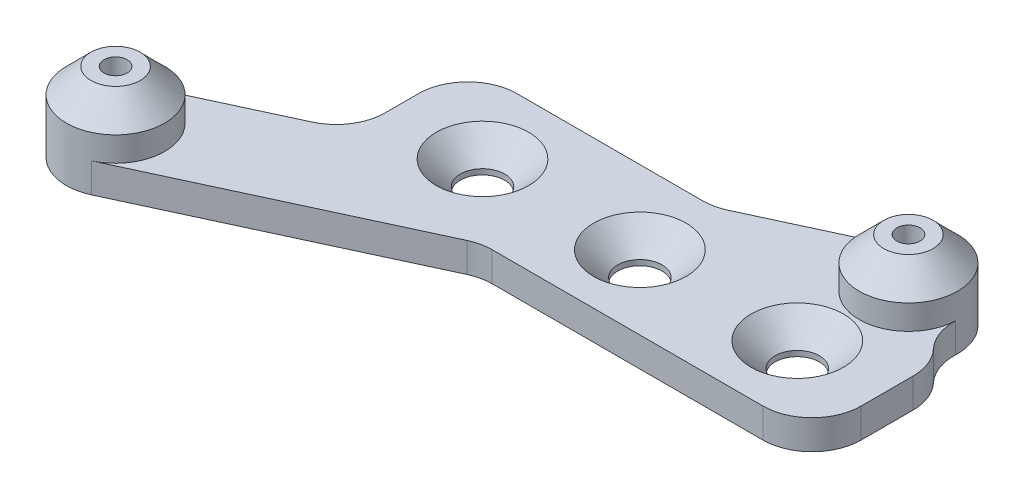
ISO-10303-21;
HEADER;
FILE_DESCRIPTION(('STEP AP214'),'2;1');
FILE_NAME('part.step','',(''),(''),'','','');
FILE_SCHEMA(('AUTOMOTIVE_DESIGN { 1 0 10303 214 1 1 1 1 }'));
ENDSEC;
DATA;
#1=APPLICATION_CONTEXT('core data for automotive mechanical design processes');
#2=APPLICATION_PROTOCOL_DEFINITION('international standard','automotive_design',2000,#1);
#3=PRODUCT_CONTEXT('',#1,'mechanical');
#4=PRODUCT('Part','Part','',(#3));
#5=PRODUCT_RELATED_PRODUCT_CATEGORY('part','',(#4));
#6=PRODUCT_DEFINITION_FORMATION('','',#4);
#7=PRODUCT_DEFINITION_CONTEXT('part definition',#1,'design');
#8=PRODUCT_DEFINITION('design','',#6,#7);
#9=PRODUCT_DEFINITION_SHAPE('','',#8);
#10=(LENGTH_UNIT() NAMED_UNIT(*) SI_UNIT(.MILLI.,.METRE.));
#11=(NAMED_UNIT(*) PLANE_ANGLE_UNIT() SI_UNIT($,.RADIAN.));
#12=(NAMED_UNIT(*) SI_UNIT($,.STERADIAN.) SOLID_ANGLE_UNIT());
#13=UNCERTAINTY_MEASURE_WITH_UNIT(LENGTH_MEASURE(1.E-05),#10,'distance_accuracy_value','');
#14=(GEOMETRIC_REPRESENTATION_CONTEXT(3) GLOBAL_UNCERTAINTY_ASSIGNED_CONTEXT((#13)) GLOBAL_UNIT_ASSIGNED_CONTEXT((#10,
#11,#12)) REPRESENTATION_CONTEXT('',''));
#15=CARTESIAN_POINT('',(0.,0.,0.));
#16=DIRECTION('',(0.,0.,1.));
#17=DIRECTION('',(1.,0.,0.));
#18=AXIS2_PLACEMENT_3D('',#15,#16,#17);
#19=CARTESIAN_POINT('',(17.3,3.,-10.));
#20=DIRECTION('',(0.,1.,0.));
#21=DIRECTION('',(0.,0.,1.));
#22=AXIS2_PLACEMENT_3D('',#19,#20,#21);
#23=PLANE('',#22);
#24=CARTESIAN_POINT('',(0.,3.,0.));
#25=DIRECTION('',(0.,1.,0.));
#26=DIRECTION('',(0.,0.,1.));
#27=AXIS2_PLACEMENT_3D('',#24,#25,#26);
#28=CIRCLE('',#27,4.7);
#29=CARTESIAN_POINT('',(0.,3.,4.7));
#30=VERTEX_POINT('',#29);
#31=EDGE_CURVE('E650',#30,#30,#28,.T.);
#32=ORIENTED_EDGE('',*,*,#31,.F.);
#33=EDGE_LOOP('',(#32));
#34=FACE_BOUND('',#33,.T.);
#35=CARTESIAN_POINT('',(-16.,3.,0.));
#36=DIRECTION('',(0.,1.,0.));
#37=DIRECTION('',(0.,0.,1.));
#38=AXIS2_PLACEMENT_3D('',#35,#36,#37);
#39=CIRCLE('',#38,4.7);
#40=CARTESIAN_POINT('',(-16.,3.,4.7));
#41=VERTEX_POINT('',#40);
#42=EDGE_CURVE('E267',#41,#41,#39,.T.);
#43=ORIENTED_EDGE('',*,*,#42,.F.);
#44=EDGE_LOOP('',(#43));
#45=FACE_BOUND('',#44,.T.);
#46=CARTESIAN_POINT('',(16.,3.,0.));
#47=DIRECTION('',(0.,1.,0.));
#48=DIRECTION('',(0.,0.,1.));
#49=AXIS2_PLACEMENT_3D('',#46,#47,#48);
#50=CIRCLE('',#49,4.7);
#51=CARTESIAN_POINT('',(16.,3.,4.7));
#52=VERTEX_POINT('',#51);
#53=EDGE_CURVE('E262',#52,#52,#50,.T.);
#54=ORIENTED_EDGE('',*,*,#53,.F.);
#55=EDGE_LOOP('',(#54));
#56=FACE_BOUND('',#55,.T.);
#57=DIRECTION('',(0.,0.,-1.));
#58=VECTOR('',#57,1.);
#59=CARTESIAN_POINT('',(25.,3.,-7.5));
#60=LINE('',#59,#58);
#61=CARTESIAN_POINT('',(25.,3.,2.5));
#62=VERTEX_POINT('',#61);
#63=CARTESIAN_POINT('',(25.,3.,-2.77319495830642));
#64=VERTEX_POINT('',#63);
#65=EDGE_CURVE('E220',#62,#64,#60,.T.);
#66=ORIENTED_EDGE('',*,*,#65,.T.);
#67=CARTESIAN_POINT('',(20.,3.,-2.77319495830642));
#68=DIRECTION('',(0.,1.,0.));
#69=DIRECTION('',(0.,0.,1.));
#70=AXIS2_PLACEMENT_3D('',#67,#68,#69);
#71=CIRCLE('',#70,5.);
#72=CARTESIAN_POINT('',(23.6463036669686,3.,-6.19437451633185));
#73=VERTEX_POINT('',#72);
#74=EDGE_CURVE('E361',#64,#73,#71,.T.);
#75=ORIENTED_EDGE('',*,*,#74,.T.);
#76=CARTESIAN_POINT('',(27.2926073339373,3.,-9.61555407435728));
#77=DIRECTION('',(0.,1.,0.));
#78=DIRECTION('',(0.,0.,1.));
#79=AXIS2_PLACEMENT_3D('',#76,#77,#78);
#80=CIRCLE('',#79,5.);
#81=CARTESIAN_POINT('',(22.2963036669686,3.,-9.80777703717865));
#82=VERTEX_POINT('',#81);
#83=EDGE_CURVE('E251',#73,#82,#80,.F.);
#84=ORIENTED_EDGE('',*,*,#83,.T.);
#85=CARTESIAN_POINT('',(17.3,3.,-10.));
#86=DIRECTION('',(0.,1.,0.));
#87=DIRECTION('',(0.,0.,1.));
#88=AXIS2_PLACEMENT_3D('',#85,#86,#87);
#89=CIRCLE('',#88,5.);
#90=CARTESIAN_POINT('',(15.2000101148058,3.,-14.5376252029098));
#91=VERTEX_POINT('',#90);
#92=EDGE_CURVE('E48',#91,#82,#89,.T.);
#93=ORIENTED_EDGE('',*,*,#92,.F.);
#94=DIRECTION('',(-0.907525040581958,0.,0.419997977038837));
#95=VECTOR('',#94,1.);
#96=CARTESIAN_POINT('',(-39.8999898851942,3.,10.9623747970902));
#97=LINE('',#96,#95);
#98=CARTESIAN_POINT('',(0.99231217909368,3.,-7.96237479709021));
#99=VERTEX_POINT('',#98);
#100=EDGE_CURVE('E156',#91,#99,#97,.T.);
#101=ORIENTED_EDGE('',*,*,#100,.T.);
#102=CARTESIAN_POINT('',(-1.10767770610051,3.,-12.5));
#103=DIRECTION('',(0.,1.,0.));
#104=DIRECTION('',(0.,0.,1.));
#105=AXIS2_PLACEMENT_3D('',#102,#103,#104);
#106=CIRCLE('',#105,5.);
#107=CARTESIAN_POINT('',(-1.10767770610051,3.,-7.5));
#108=VERTEX_POINT('',#107);
#109=EDGE_CURVE('E243',#99,#108,#106,.F.);
#110=ORIENTED_EDGE('',*,*,#109,.T.);
#111=DIRECTION('',(-1.,0.,0.));
#112=VECTOR('',#111,1.);
#113=CARTESIAN_POINT('',(25.,3.,-7.5));
#114=LINE('',#113,#112);
#115=CARTESIAN_POINT('',(-20.,3.,-7.5));
#116=VERTEX_POINT('',#115);
#117=EDGE_CURVE('E215',#108,#116,#114,.T.);
#118=ORIENTED_EDGE('',*,*,#117,.T.);
#119=CARTESIAN_POINT('',(-20.,3.,-2.5));
#120=DIRECTION('',(0.,1.,0.));
#121=DIRECTION('',(0.,0.,1.));
#122=AXIS2_PLACEMENT_3D('',#119,#120,#121);
#123=CIRCLE('',#122,5.);
#124=CARTESIAN_POINT('',(-25.,3.,-2.49999999999999));
#125=VERTEX_POINT('',#124);
#126=EDGE_CURVE('E404',#116,#125,#123,.T.);
#127=ORIENTED_EDGE('',*,*,#126,.T.);
#128=DIRECTION('',(0.,0.,1.));
#129=VECTOR('',#128,1.);
#130=CARTESIAN_POINT('',(-25.,3.,-7.5));
#131=LINE('',#130,#129);
#132=CARTESIAN_POINT('',(-25.,3.,0.871219936378182));
#133=VERTEX_POINT('',#132);
#134=EDGE_CURVE('E370',#125,#133,#131,.T.);
#135=ORIENTED_EDGE('',*,*,#134,.T.);
#136=CARTESIAN_POINT('',(-30.,3.,0.871219936378183));
#137=DIRECTION('',(0.,1.,0.));
#138=DIRECTION('',(0.,0.,1.));
#139=AXIS2_PLACEMENT_3D('',#136,#137,#138);
#140=CIRCLE('',#139,5.);
#141=CARTESIAN_POINT('',(-27.9000101148058,3.,5.40884513928797));
#142=VERTEX_POINT('',#141);
#143=EDGE_CURVE('E231',#133,#142,#140,.F.);
#144=ORIENTED_EDGE('',*,*,#143,.T.);
#145=CARTESIAN_POINT('',(-39.8999898851942,3.,10.9623747970902));
#146=VERTEX_POINT('',#145);
#147=EDGE_CURVE('E169',#142,#146,#97,.T.);
#148=ORIENTED_EDGE('',*,*,#147,.T.);
#149=CARTESIAN_POINT('',(-37.8,3.,15.5));
#150=DIRECTION('',(0.,1.,0.));
#151=DIRECTION('',(0.,0.,1.));
#152=AXIS2_PLACEMENT_3D('',#149,#150,#151);
#153=CIRCLE('',#152,5.);
#154=CARTESIAN_POINT('',(-35.7000101148058,3.,20.0376252029098));
#155=VERTEX_POINT('',#154);
#156=EDGE_CURVE('E162',#155,#146,#153,.T.);
#157=ORIENTED_EDGE('',*,*,#156,.F.);
#158=DIRECTION('',(0.907525040581958,0.,-0.419997977038837));
#159=VECTOR('',#158,1.);
#160=CARTESIAN_POINT('',(-35.7000101148058,3.,20.0376252029098));
#161=LINE('',#160,#159);
#162=CARTESIAN_POINT('',(-9.60799845360353,3.,7.96237479709021));
#163=VERTEX_POINT('',#162);
#164=EDGE_CURVE('E145',#155,#163,#161,.T.);
#165=ORIENTED_EDGE('',*,*,#164,.T.);
#166=CARTESIAN_POINT('',(-7.50800856840935,3.,12.5));
#167=DIRECTION('',(0.,1.,0.));
#168=DIRECTION('',(0.,0.,1.));
#169=AXIS2_PLACEMENT_3D('',#166,#167,#168);
#170=CIRCLE('',#169,5.);
#171=CARTESIAN_POINT('',(-7.50800856840935,3.,7.5));
#172=VERTEX_POINT('',#171);
#173=EDGE_CURVE('E230',#163,#172,#170,.F.);
#174=ORIENTED_EDGE('',*,*,#173,.T.);
#175=DIRECTION('',(1.,0.,0.));
#176=VECTOR('',#175,1.);
#177=CARTESIAN_POINT('',(25.,3.,7.5));
#178=LINE('',#177,#176);
#179=CARTESIAN_POINT('',(20.,3.,7.5));
#180=VERTEX_POINT('',#179);
#181=EDGE_CURVE('E368',#172,#180,#178,.T.);
#182=ORIENTED_EDGE('',*,*,#181,.T.);
#183=CARTESIAN_POINT('',(20.,3.,2.5));
#184=DIRECTION('',(0.,1.,0.));
#185=DIRECTION('',(0.,0.,1.));
#186=AXIS2_PLACEMENT_3D('',#183,#184,#185);
#187=CIRCLE('',#186,5.);
#188=EDGE_CURVE('E206',#180,#62,#187,.T.);
#189=ORIENTED_EDGE('',*,*,#188,.T.);
#190=EDGE_LOOP('',(#66,#75,#84,#93,#101,#110,#118,#127,#135,#144,#148,#157,#165,#174,#182,#189));
#191=FACE_BOUND('',#190,.T.);
#192=ADVANCED_FACE('F33',(#34,#45,#56,#191),#23,.T.);
#193=CARTESIAN_POINT('',(17.3,3.,-10.));
#194=DIRECTION('',(0.,-1.,0.));
#195=DIRECTION('',(0.,0.,-1.));
#196=AXIS2_PLACEMENT_3D('',#193,#194,#195);
#197=CYLINDRICAL_SURFACE('',#196,5.);
#198=CARTESIAN_POINT('',(17.3,5.49999999999998,-10.));
#199=DIRECTION('',(0.,1.,0.));
#200=DIRECTION('',(0.,0.,1.));
#201=AXIS2_PLACEMENT_3D('',#198,#199,#200);
#202=CIRCLE('',#201,5.);
#203=CARTESIAN_POINT('',(17.3,5.49999999999998,-5.00000000000002));
#204=VERTEX_POINT('',#203);
#205=EDGE_CURVE('E271',#204,#204,#202,.F.);
#206=ORIENTED_EDGE('',*,*,#205,.T.);
#207=EDGE_LOOP('',(#206));
#208=FACE_BOUND('',#207,.T.);
#209=ORIENTED_EDGE('',*,*,#92,.T.);
#210=DIRECTION('',(0.,-1.,0.));
#211=VECTOR('',#210,1.);
#212=CARTESIAN_POINT('',(22.2963036669686,3.,-9.80777703717865));
#213=LINE('',#212,#211);
#214=CARTESIAN_POINT('',(22.2963036669686,0.,-9.80777703717865));
#215=VERTEX_POINT('',#214);
#216=EDGE_CURVE('E53',#82,#215,#213,.T.);
#217=ORIENTED_EDGE('',*,*,#216,.T.);
#218=CARTESIAN_POINT('',(17.3,0.,-10.));
#219=DIRECTION('',(0.,1.,0.));
#220=DIRECTION('',(0.,0.,1.));
#221=AXIS2_PLACEMENT_3D('',#218,#219,#220);
#222=CIRCLE('',#221,5.);
#223=CARTESIAN_POINT('',(15.2000101148058,0.,-14.5376252029098));
#224=VERTEX_POINT('',#223);
#225=EDGE_CURVE('E217',#215,#224,#222,.T.);
#226=ORIENTED_EDGE('',*,*,#225,.T.);
#227=DIRECTION('',(0.,-1.,0.));
#228=VECTOR('',#227,1.);
#229=CARTESIAN_POINT('',(15.2000101148058,3.,-14.5376252029098));
#230=LINE('',#229,#228);
#231=EDGE_CURVE('E185',#91,#224,#230,.T.);
#232=ORIENTED_EDGE('',*,*,#231,.F.);
#233=EDGE_LOOP('',(#209,#217,#226,#232));
#234=FACE_BOUND('',#233,.T.);
#235=ADVANCED_FACE('F289',(#208,#234),#197,.T.);
#236=CARTESIAN_POINT('',(-39.8999898851942,3.,10.9623747970902));
#237=DIRECTION('',(0.419997977038837,0.,0.907525040581958));
#238=DIRECTION('',(0.907525040581958,0.,-0.419997977038838));
#239=AXIS2_PLACEMENT_3D('',#236,#237,#238);
#240=PLANE('',#239);
#241=ORIENTED_EDGE('',*,*,#147,.F.);
#242=DIRECTION('',(0.,1.,0.));
#243=VECTOR('',#242,1.);
#244=CARTESIAN_POINT('',(-27.9000101148058,0.,5.40884513928797));
#245=LINE('',#244,#243);
#246=CARTESIAN_POINT('',(-27.9000101148058,0.,5.40884513928797));
#247=VERTEX_POINT('',#246);
#248=EDGE_CURVE('E396',#142,#247,#245,.F.);
#249=ORIENTED_EDGE('',*,*,#248,.T.);
#250=DIRECTION('',(-0.907525040581958,0.,0.419997977038837));
#251=VECTOR('',#250,1.);
#252=CARTESIAN_POINT('',(-39.8999898851942,0.,10.9623747970902));
#253=LINE('',#252,#251);
#254=CARTESIAN_POINT('',(-39.8999898851942,0.,10.9623747970902));
#255=VERTEX_POINT('',#254);
#256=EDGE_CURVE('E219',#247,#255,#253,.T.);
#257=ORIENTED_EDGE('',*,*,#256,.T.);
#258=DIRECTION('',(0.,-1.,0.));
#259=VECTOR('',#258,1.);
#260=CARTESIAN_POINT('',(-39.8999898851942,3.,10.9623747970902));
#261=LINE('',#260,#259);
#262=EDGE_CURVE('E165',#146,#255,#261,.T.);
#263=ORIENTED_EDGE('',*,*,#262,.F.);
#264=EDGE_LOOP('',(#241,#249,#257,#263));
#265=FACE_BOUND('',#264,.T.);
#266=ADVANCED_FACE('F297',(#265),#240,.F.);
#267=CARTESIAN_POINT('',(0.99231217909368,0.,-7.96237479709021));
#268=VERTEX_POINT('',#267);
#269=EDGE_CURVE('E221',#224,#268,#253,.T.);
#270=ORIENTED_EDGE('',*,*,#269,.T.);
#271=DIRECTION('',(0.,-1.,0.));
#272=VECTOR('',#271,1.);
#273=CARTESIAN_POINT('',(0.992312179093677,3.,-7.96237479709021));
#274=LINE('',#273,#272);
#275=EDGE_CURVE('E389',#268,#99,#274,.F.);
#276=ORIENTED_EDGE('',*,*,#275,.T.);
#277=ORIENTED_EDGE('',*,*,#100,.F.);
#278=ORIENTED_EDGE('',*,*,#231,.T.);
#279=EDGE_LOOP('',(#270,#276,#277,#278));
#280=FACE_BOUND('',#279,.T.);
#281=ADVANCED_FACE('F313',(#280),#240,.F.);
#282=CARTESIAN_POINT('',(-35.7000101148058,3.,20.0376252029098));
#283=DIRECTION('',(-0.419997977038837,0.,-0.907525040581958));
#284=DIRECTION('',(-0.907525040581958,0.,0.419997977038838));
#285=AXIS2_PLACEMENT_3D('',#282,#283,#284);
#286=PLANE('',#285);
#287=DIRECTION('',(0.907525040581958,0.,-0.419997977038837));
#288=VECTOR('',#287,1.);
#289=CARTESIAN_POINT('',(-35.7000101148058,0.,20.0376252029098));
#290=LINE('',#289,#288);
#291=CARTESIAN_POINT('',(-35.7000101148058,0.,20.0376252029098));
#292=VERTEX_POINT('',#291);
#293=CARTESIAN_POINT('',(-9.60799845360353,0.,7.96237479709021));
#294=VERTEX_POINT('',#293);
#295=EDGE_CURVE('E209',#292,#294,#290,.T.);
#296=ORIENTED_EDGE('',*,*,#295,.T.);
#297=DIRECTION('',(0.,-1.,0.));
#298=VECTOR('',#297,1.);
#299=CARTESIAN_POINT('',(-9.60799845360353,3.,7.96237479709021));
#300=LINE('',#299,#298);
#301=EDGE_CURVE('E152',#294,#163,#300,.F.);
#302=ORIENTED_EDGE('',*,*,#301,.T.);
#303=ORIENTED_EDGE('',*,*,#164,.F.);
#304=DIRECTION('',(0.,-1.,0.));
#305=VECTOR('',#304,1.);
#306=CARTESIAN_POINT('',(-35.7000101148058,3.,20.0376252029098));
#307=LINE('',#306,#305);
#308=EDGE_CURVE('E149',#155,#292,#307,.T.);
#309=ORIENTED_EDGE('',*,*,#308,.T.);
#310=EDGE_LOOP('',(#296,#302,#303,#309));
#311=FACE_BOUND('',#310,.T.);
#312=ADVANCED_FACE('F148',(#311),#286,.F.);
#313=CARTESIAN_POINT('',(-37.8,3.,15.5));
#314=DIRECTION('',(0.,-1.,0.));
#315=DIRECTION('',(0.,0.,-1.));
#316=AXIS2_PLACEMENT_3D('',#313,#314,#315);
#317=CYLINDRICAL_SURFACE('',#316,5.);
#318=CARTESIAN_POINT('',(-37.8,5.49999999999999,15.5));
#319=DIRECTION('',(0.,1.,0.));
#320=DIRECTION('',(0.,0.,1.));
#321=AXIS2_PLACEMENT_3D('',#318,#319,#320);
#322=CIRCLE('',#321,5.);
#323=CARTESIAN_POINT('',(-37.8,5.49999999999999,20.5));
#324=VERTEX_POINT('',#323);
#325=EDGE_CURVE('E11',#324,#324,#322,.F.);
#326=ORIENTED_EDGE('',*,*,#325,.T.);
#327=EDGE_LOOP('',(#326));
#328=FACE_BOUND('',#327,.T.);
#329=CARTESIAN_POINT('',(-37.8,0.,15.5));
#330=DIRECTION('',(0.,1.,0.));
#331=DIRECTION('',(0.,0.,1.));
#332=AXIS2_PLACEMENT_3D('',#329,#330,#331);
#333=CIRCLE('',#332,5.);
#334=EDGE_CURVE('E164',#255,#292,#333,.T.);
#335=ORIENTED_EDGE('',*,*,#334,.T.);
#336=ORIENTED_EDGE('',*,*,#308,.F.);
#337=ORIENTED_EDGE('',*,*,#156,.T.);
#338=ORIENTED_EDGE('',*,*,#262,.T.);
#339=EDGE_LOOP('',(#335,#336,#337,#338));
#340=FACE_BOUND('',#339,.T.);
#341=ADVANCED_FACE('F160',(#328,#340),#317,.T.);
#342=CARTESIAN_POINT('',(17.3,0.,-10.));
#343=DIRECTION('',(0.,1.,0.));
#344=DIRECTION('',(0.,0.,1.));
#345=AXIS2_PLACEMENT_3D('',#342,#343,#344);
#346=PLANE('',#345);
#347=CARTESIAN_POINT('',(17.3,0.,-10.));
#348=DIRECTION('',(0.,1.,0.));
#349=DIRECTION('',(0.,0.,1.));
#350=AXIS2_PLACEMENT_3D('',#347,#348,#349);
#351=CIRCLE('',#350,1.175);
#352=CARTESIAN_POINT('',(17.3,0.,-8.82500000000002));
#353=VERTEX_POINT('',#352);
#354=EDGE_CURVE('E639',#353,#353,#351,.T.);
#355=ORIENTED_EDGE('',*,*,#354,.T.);
#356=EDGE_LOOP('',(#355));
#357=FACE_BOUND('',#356,.T.);
#358=CARTESIAN_POINT('',(-37.8,0.,15.5));
#359=DIRECTION('',(0.,1.,0.));
#360=DIRECTION('',(0.,0.,1.));
#361=AXIS2_PLACEMENT_3D('',#358,#359,#360);
#362=CIRCLE('',#361,1.175);
#363=CARTESIAN_POINT('',(-37.8,0.,16.675));
#364=VERTEX_POINT('',#363);
#365=EDGE_CURVE('E647',#364,#364,#362,.T.);
#366=ORIENTED_EDGE('',*,*,#365,.T.);
#367=EDGE_LOOP('',(#366));
#368=FACE_BOUND('',#367,.T.);
#369=CARTESIAN_POINT('',(0.,0.,0.));
#370=DIRECTION('',(0.,1.,0.));
#371=DIRECTION('',(0.,0.,1.));
#372=AXIS2_PLACEMENT_3D('',#369,#370,#371);
#373=CIRCLE('',#372,2.24999999999999);
#374=CARTESIAN_POINT('',(0.,0.,2.24999999999999));
#375=VERTEX_POINT('',#374);
#376=EDGE_CURVE('E264',#375,#375,#373,.T.);
#377=ORIENTED_EDGE('',*,*,#376,.T.);
#378=EDGE_LOOP('',(#377));
#379=FACE_BOUND('',#378,.T.);
#380=CARTESIAN_POINT('',(-16.,0.,0.));
#381=DIRECTION('',(0.,1.,0.));
#382=DIRECTION('',(0.,0.,1.));
#383=AXIS2_PLACEMENT_3D('',#380,#381,#382);
#384=CIRCLE('',#383,2.24999999999999);
#385=CARTESIAN_POINT('',(-16.,0.,2.25));
#386=VERTEX_POINT('',#385);
#387=EDGE_CURVE('E259',#386,#386,#384,.T.);
#388=ORIENTED_EDGE('',*,*,#387,.T.);
#389=EDGE_LOOP('',(#388));
#390=FACE_BOUND('',#389,.T.);
#391=CARTESIAN_POINT('',(16.,0.,0.));
#392=DIRECTION('',(0.,1.,0.));
#393=DIRECTION('',(0.,0.,1.));
#394=AXIS2_PLACEMENT_3D('',#391,#392,#393);
#395=CIRCLE('',#394,2.24999999999999);
#396=CARTESIAN_POINT('',(16.,0.,2.24999999999999));
#397=VERTEX_POINT('',#396);
#398=EDGE_CURVE('E176',#397,#397,#395,.T.);
#399=ORIENTED_EDGE('',*,*,#398,.T.);
#400=EDGE_LOOP('',(#399));
#401=FACE_BOUND('',#400,.T.);
#402=ORIENTED_EDGE('',*,*,#225,.F.);
#403=CARTESIAN_POINT('',(27.2926073339373,0.,-9.61555407435728));
#404=DIRECTION('',(0.,1.,0.));
#405=DIRECTION('',(0.,0.,1.));
#406=AXIS2_PLACEMENT_3D('',#403,#404,#405);
#407=CIRCLE('',#406,5.);
#408=CARTESIAN_POINT('',(23.6463036669686,0.,-6.19437451633185));
#409=VERTEX_POINT('',#408);
#410=EDGE_CURVE('E253',#215,#409,#407,.T.);
#411=ORIENTED_EDGE('',*,*,#410,.T.);
#412=CARTESIAN_POINT('',(20.,0.,-2.77319495830642));
#413=DIRECTION('',(0.,1.,0.));
#414=DIRECTION('',(0.,0.,1.));
#415=AXIS2_PLACEMENT_3D('',#412,#413,#414);
#416=CIRCLE('',#415,5.);
#417=CARTESIAN_POINT('',(25.,0.,-2.77319495830642));
#418=VERTEX_POINT('',#417);
#419=EDGE_CURVE('E199',#409,#418,#416,.F.);
#420=ORIENTED_EDGE('',*,*,#419,.T.);
#421=DIRECTION('',(0.,0.,-1.));
#422=VECTOR('',#421,1.);
#423=CARTESIAN_POINT('',(25.,0.,-7.5));
#424=LINE('',#423,#422);
#425=CARTESIAN_POINT('',(25.,0.,2.5));
#426=VERTEX_POINT('',#425);
#427=EDGE_CURVE('E365',#426,#418,#424,.T.);
#428=ORIENTED_EDGE('',*,*,#427,.F.);
#429=CARTESIAN_POINT('',(20.,0.,2.5));
#430=DIRECTION('',(0.,1.,0.));
#431=DIRECTION('',(0.,0.,1.));
#432=AXIS2_PLACEMENT_3D('',#429,#430,#431);
#433=CIRCLE('',#432,5.);
#434=CARTESIAN_POINT('',(20.,0.,7.5));
#435=VERTEX_POINT('',#434);
#436=EDGE_CURVE('E195',#426,#435,#433,.F.);
#437=ORIENTED_EDGE('',*,*,#436,.T.);
#438=DIRECTION('',(1.,0.,0.));
#439=VECTOR('',#438,1.);
#440=CARTESIAN_POINT('',(25.,0.,7.5));
#441=LINE('',#440,#439);
#442=CARTESIAN_POINT('',(-7.50800856840935,0.,7.5));
#443=VERTEX_POINT('',#442);
#444=EDGE_CURVE('E174',#443,#435,#441,.T.);
#445=ORIENTED_EDGE('',*,*,#444,.F.);
#446=CARTESIAN_POINT('',(-7.50800856840935,0.,12.5));
#447=DIRECTION('',(0.,1.,0.));
#448=DIRECTION('',(0.,0.,1.));
#449=AXIS2_PLACEMENT_3D('',#446,#447,#448);
#450=CIRCLE('',#449,5.);
#451=EDGE_CURVE('E228',#443,#294,#450,.T.);
#452=ORIENTED_EDGE('',*,*,#451,.T.);
#453=ORIENTED_EDGE('',*,*,#295,.F.);
#454=ORIENTED_EDGE('',*,*,#334,.F.);
#455=ORIENTED_EDGE('',*,*,#256,.F.);
#456=CARTESIAN_POINT('',(-30.,0.,0.871219936378183));
#457=DIRECTION('',(0.,1.,0.));
#458=DIRECTION('',(0.,0.,1.));
#459=AXIS2_PLACEMENT_3D('',#456,#457,#458);
#460=CIRCLE('',#459,5.);
#461=CARTESIAN_POINT('',(-25.,0.,0.871219936378182));
#462=VERTEX_POINT('',#461);
#463=EDGE_CURVE('E234',#247,#462,#460,.T.);
#464=ORIENTED_EDGE('',*,*,#463,.T.);
#465=DIRECTION('',(0.,0.,1.));
#466=VECTOR('',#465,1.);
#467=CARTESIAN_POINT('',(-25.,0.,-7.5));
#468=LINE('',#467,#466);
#469=CARTESIAN_POINT('',(-25.,0.,-2.49999999999999));
#470=VERTEX_POINT('',#469);
#471=EDGE_CURVE('E171',#470,#462,#468,.T.);
#472=ORIENTED_EDGE('',*,*,#471,.F.);
#473=CARTESIAN_POINT('',(-20.,0.,-2.5));
#474=DIRECTION('',(0.,1.,0.));
#475=DIRECTION('',(0.,0.,1.));
#476=AXIS2_PLACEMENT_3D('',#473,#474,#475);
#477=CIRCLE('',#476,5.);
#478=CARTESIAN_POINT('',(-20.,0.,-7.5));
#479=VERTEX_POINT('',#478);
#480=EDGE_CURVE('E197',#470,#479,#477,.F.);
#481=ORIENTED_EDGE('',*,*,#480,.T.);
#482=DIRECTION('',(-1.,0.,0.));
#483=VECTOR('',#482,1.);
#484=CARTESIAN_POINT('',(25.,0.,-7.5));
#485=LINE('',#484,#483);
#486=CARTESIAN_POINT('',(-1.10767770610051,0.,-7.5));
#487=VERTEX_POINT('',#486);
#488=EDGE_CURVE('E181',#487,#479,#485,.T.);
#489=ORIENTED_EDGE('',*,*,#488,.F.);
#490=CARTESIAN_POINT('',(-1.10767770610051,0.,-12.5));
#491=DIRECTION('',(0.,1.,0.));
#492=DIRECTION('',(0.,0.,1.));
#493=AXIS2_PLACEMENT_3D('',#490,#491,#492);
#494=CIRCLE('',#493,5.);
#495=EDGE_CURVE('E241',#487,#268,#494,.T.);
#496=ORIENTED_EDGE('',*,*,#495,.T.);
#497=ORIENTED_EDGE('',*,*,#269,.F.);
#498=EDGE_LOOP('',(#402,#411,#420,#428,#437,#445,#452,#453,#454,#455,#464,#472,#481,#489,#496,#497));
#499=FACE_BOUND('',#498,.T.);
#500=ADVANCED_FACE('F306',(#357,#368,#379,#390,#401,#499),#346,.F.);
#501=CARTESIAN_POINT('',(25.,55.2015325445527,-7.5));
#502=DIRECTION('',(-1.,0.,0.));
#503=DIRECTION('',(0.,0.,1.));
#504=AXIS2_PLACEMENT_3D('',#501,#502,#503);
#505=PLANE('',#504);
#506=ORIENTED_EDGE('',*,*,#427,.T.);
#507=DIRECTION('',(0.,-1.,0.));
#508=VECTOR('',#507,1.);
#509=CARTESIAN_POINT('',(25.,55.2015325445527,-2.77319495830642));
#510=LINE('',#509,#508);
#511=EDGE_CURVE('E204',#418,#64,#510,.F.);
#512=ORIENTED_EDGE('',*,*,#511,.T.);
#513=ORIENTED_EDGE('',*,*,#65,.F.);
#514=DIRECTION('',(0.,-1.,0.));
#515=VECTOR('',#514,1.);
#516=CARTESIAN_POINT('',(25.,55.2015325445527,2.5));
#517=LINE('',#516,#515);
#518=EDGE_CURVE('E201',#62,#426,#517,.T.);
#519=ORIENTED_EDGE('',*,*,#518,.T.);
#520=EDGE_LOOP('',(#506,#512,#513,#519));
#521=FACE_BOUND('',#520,.T.);
#522=ADVANCED_FACE('F309',(#521),#505,.F.);
#523=CARTESIAN_POINT('',(25.,55.2015325445527,7.5));
#524=DIRECTION('',(0.,0.,-1.));
#525=DIRECTION('',(-1.,0.,0.));
#526=AXIS2_PLACEMENT_3D('',#523,#524,#525);
#527=PLANE('',#526);
#528=ORIENTED_EDGE('',*,*,#181,.F.);
#529=DIRECTION('',(0.,-1.,0.));
#530=VECTOR('',#529,1.);
#531=CARTESIAN_POINT('',(-7.50800856840935,0.,7.5));
#532=LINE('',#531,#530);
#533=EDGE_CURVE('E232',#172,#443,#532,.T.);
#534=ORIENTED_EDGE('',*,*,#533,.T.);
#535=ORIENTED_EDGE('',*,*,#444,.T.);
#536=DIRECTION('',(0.,-1.,0.));
#537=VECTOR('',#536,1.);
#538=CARTESIAN_POINT('',(20.,55.2015325445527,7.5));
#539=LINE('',#538,#537);
#540=EDGE_CURVE('E236',#435,#180,#539,.F.);
#541=ORIENTED_EDGE('',*,*,#540,.T.);
#542=EDGE_LOOP('',(#528,#534,#535,#541));
#543=FACE_BOUND('',#542,.T.);
#544=ADVANCED_FACE('F388',(#543),#527,.F.);
#545=CARTESIAN_POINT('',(-25.,55.2015325445527,-7.5));
#546=DIRECTION('',(1.,0.,0.));
#547=DIRECTION('',(0.,0.,-1.));
#548=AXIS2_PLACEMENT_3D('',#545,#546,#547);
#549=PLANE('',#548);
#550=ORIENTED_EDGE('',*,*,#471,.T.);
#551=DIRECTION('',(0.,1.,0.));
#552=VECTOR('',#551,1.);
#553=CARTESIAN_POINT('',(-25.,3.,0.871219936378182));
#554=LINE('',#553,#552);
#555=EDGE_CURVE('E398',#462,#133,#554,.T.);
#556=ORIENTED_EDGE('',*,*,#555,.T.);
#557=ORIENTED_EDGE('',*,*,#134,.F.);
#558=DIRECTION('',(0.,-1.,0.));
#559=VECTOR('',#558,1.);
#560=CARTESIAN_POINT('',(-25.,55.2015325445527,-2.49999999999999));
#561=LINE('',#560,#559);
#562=EDGE_CURVE('E401',#125,#470,#561,.T.);
#563=ORIENTED_EDGE('',*,*,#562,.T.);
#564=EDGE_LOOP('',(#550,#556,#557,#563));
#565=FACE_BOUND('',#564,.T.);
#566=ADVANCED_FACE('F304',(#565),#549,.F.);
#567=CARTESIAN_POINT('',(25.,55.2015325445527,-7.5));
#568=DIRECTION('',(0.,0.,1.));
#569=DIRECTION('',(1.,0.,0.));
#570=AXIS2_PLACEMENT_3D('',#567,#568,#569);
#571=PLANE('',#570);
#572=ORIENTED_EDGE('',*,*,#488,.T.);
#573=DIRECTION('',(0.,-1.,0.));
#574=VECTOR('',#573,1.);
#575=CARTESIAN_POINT('',(-20.,55.2015325445527,-7.5));
#576=LINE('',#575,#574);
#577=EDGE_CURVE('E390',#479,#116,#576,.F.);
#578=ORIENTED_EDGE('',*,*,#577,.T.);
#579=ORIENTED_EDGE('',*,*,#117,.F.);
#580=DIRECTION('',(0.,-1.,0.));
#581=VECTOR('',#580,1.);
#582=CARTESIAN_POINT('',(-1.10767770610051,0.,-7.5));
#583=LINE('',#582,#581);
#584=EDGE_CURVE('E394',#108,#487,#583,.T.);
#585=ORIENTED_EDGE('',*,*,#584,.T.);
#586=EDGE_LOOP('',(#572,#578,#579,#585));
#587=FACE_BOUND('',#586,.T.);
#588=ADVANCED_FACE('F418',(#587),#571,.F.);
#589=CARTESIAN_POINT('',(-37.8,8.,15.5));
#590=DIRECTION('',(0.,1.,0.));
#591=DIRECTION('',(0.,0.,1.));
#592=AXIS2_PLACEMENT_3D('',#589,#590,#591);
#593=PLANE('',#592);
#594=CARTESIAN_POINT('',(-37.8,8.,15.5));
#595=DIRECTION('',(0.,1.,0.));
#596=DIRECTION('',(0.,0.,1.));
#597=AXIS2_PLACEMENT_3D('',#594,#595,#596);
#598=CIRCLE('',#597,2.50000000000001);
#599=CARTESIAN_POINT('',(-37.8,8.,18.));
#600=VERTEX_POINT('',#599);
#601=EDGE_CURVE('E41',#600,#600,#598,.T.);
#602=ORIENTED_EDGE('',*,*,#601,.T.);
#603=EDGE_LOOP('',(#602));
#604=FACE_BOUND('',#603,.T.);
#605=CARTESIAN_POINT('',(-37.8,8.,15.5));
#606=DIRECTION('',(0.,1.,0.));
#607=DIRECTION('',(0.,0.,1.));
#608=AXIS2_PLACEMENT_3D('',#605,#606,#607);
#609=CIRCLE('',#608,1.175);
#610=CARTESIAN_POINT('',(-37.8,8.,16.675));
#611=VERTEX_POINT('',#610);
#612=EDGE_CURVE('E642',#611,#611,#609,.T.);
#613=ORIENTED_EDGE('',*,*,#612,.F.);
#614=EDGE_LOOP('',(#613));
#615=FACE_BOUND('',#614,.T.);
#616=ADVANCED_FACE('F276',(#604,#615),#593,.T.);
#617=CARTESIAN_POINT('',(17.3,8.,-10.));
#618=DIRECTION('',(0.,1.,0.));
#619=DIRECTION('',(0.,0.,1.));
#620=AXIS2_PLACEMENT_3D('',#617,#618,#619);
#621=PLANE('',#620);
#622=CARTESIAN_POINT('',(17.3,8.,-10.));
#623=DIRECTION('',(0.,1.,0.));
#624=DIRECTION('',(0.,0.,1.));
#625=AXIS2_PLACEMENT_3D('',#622,#623,#624);
#626=CIRCLE('',#625,2.49999999999999);
#627=CARTESIAN_POINT('',(17.3,8.,-7.50000000000003));
#628=VERTEX_POINT('',#627);
#629=EDGE_CURVE('E255',#628,#628,#626,.T.);
#630=ORIENTED_EDGE('',*,*,#629,.T.);
#631=EDGE_LOOP('',(#630));
#632=FACE_BOUND('',#631,.T.);
#633=CARTESIAN_POINT('',(17.3,8.,-10.));
#634=DIRECTION('',(0.,1.,0.));
#635=DIRECTION('',(0.,0.,1.));
#636=AXIS2_PLACEMENT_3D('',#633,#634,#635);
#637=CIRCLE('',#636,1.175);
#638=CARTESIAN_POINT('',(17.3,8.,-8.82500000000002));
#639=VERTEX_POINT('',#638);
#640=EDGE_CURVE('E638',#639,#639,#637,.T.);
#641=ORIENTED_EDGE('',*,*,#640,.F.);
#642=EDGE_LOOP('',(#641));
#643=FACE_BOUND('',#642,.T.);
#644=ADVANCED_FACE('F324',(#632,#643),#621,.T.);
#645=CARTESIAN_POINT('',(20.,3.,-2.77319495830642));
#646=DIRECTION('',(0.,-1.,0.));
#647=DIRECTION('',(0.,0.,-1.));
#648=AXIS2_PLACEMENT_3D('',#645,#646,#647);
#649=CYLINDRICAL_SURFACE('',#648,5.);
#650=ORIENTED_EDGE('',*,*,#419,.F.);
#651=DIRECTION('',(0.,-1.,0.));
#652=VECTOR('',#651,1.);
#653=CARTESIAN_POINT('',(23.6463036669686,3.,-6.19437451633185));
#654=LINE('',#653,#652);
#655=EDGE_CURVE('E247',#409,#73,#654,.F.);
#656=ORIENTED_EDGE('',*,*,#655,.T.);
#657=ORIENTED_EDGE('',*,*,#74,.F.);
#658=ORIENTED_EDGE('',*,*,#511,.F.);
#659=EDGE_LOOP('',(#650,#656,#657,#658));
#660=FACE_BOUND('',#659,.T.);
#661=ADVANCED_FACE('F320',(#660),#649,.T.);
#662=CARTESIAN_POINT('',(-30.,55.2015325445527,0.871219936378183));
#663=DIRECTION('',(0.,-1.,0.));
#664=DIRECTION('',(0.,0.,-1.));
#665=AXIS2_PLACEMENT_3D('',#662,#663,#664);
#666=CYLINDRICAL_SURFACE('',#665,5.);
#667=ORIENTED_EDGE('',*,*,#463,.F.);
#668=ORIENTED_EDGE('',*,*,#248,.F.);
#669=ORIENTED_EDGE('',*,*,#143,.F.);
#670=ORIENTED_EDGE('',*,*,#555,.F.);
#671=EDGE_LOOP('',(#667,#668,#669,#670));
#672=FACE_BOUND('',#671,.T.);
#673=ADVANCED_FACE('F323',(#672),#666,.F.);
#674=CARTESIAN_POINT('',(-20.,55.2015325445527,-2.5));
#675=DIRECTION('',(0.,-1.,0.));
#676=DIRECTION('',(0.,0.,-1.));
#677=AXIS2_PLACEMENT_3D('',#674,#675,#676);
#678=CYLINDRICAL_SURFACE('',#677,5.);
#679=ORIENTED_EDGE('',*,*,#126,.F.);
#680=ORIENTED_EDGE('',*,*,#577,.F.);
#681=ORIENTED_EDGE('',*,*,#480,.F.);
#682=ORIENTED_EDGE('',*,*,#562,.F.);
#683=EDGE_LOOP('',(#679,#680,#681,#682));
#684=FACE_BOUND('',#683,.T.);
#685=ADVANCED_FACE('F328',(#684),#678,.T.);
#686=CARTESIAN_POINT('',(-1.10767770610051,55.2015325445527,-12.5));
#687=DIRECTION('',(0.,1.,0.));
#688=DIRECTION('',(0.,0.,1.));
#689=AXIS2_PLACEMENT_3D('',#686,#687,#688);
#690=CYLINDRICAL_SURFACE('',#689,5.);
#691=ORIENTED_EDGE('',*,*,#109,.F.);
#692=ORIENTED_EDGE('',*,*,#275,.F.);
#693=ORIENTED_EDGE('',*,*,#495,.F.);
#694=ORIENTED_EDGE('',*,*,#584,.F.);
#695=EDGE_LOOP('',(#691,#692,#693,#694));
#696=FACE_BOUND('',#695,.T.);
#697=ADVANCED_FACE('F332',(#696),#690,.F.);
#698=CARTESIAN_POINT('',(-7.50800856840935,55.2015325445527,12.5));
#699=DIRECTION('',(0.,1.,0.));
#700=DIRECTION('',(0.,0.,1.));
#701=AXIS2_PLACEMENT_3D('',#698,#699,#700);
#702=CYLINDRICAL_SURFACE('',#701,5.);
#703=ORIENTED_EDGE('',*,*,#173,.F.);
#704=ORIENTED_EDGE('',*,*,#301,.F.);
#705=ORIENTED_EDGE('',*,*,#451,.F.);
#706=ORIENTED_EDGE('',*,*,#533,.F.);
#707=EDGE_LOOP('',(#703,#704,#705,#706));
#708=FACE_BOUND('',#707,.T.);
#709=ADVANCED_FACE('F226',(#708),#702,.F.);
#710=CARTESIAN_POINT('',(20.,55.2015325445527,2.5));
#711=DIRECTION('',(0.,-1.,0.));
#712=DIRECTION('',(0.,0.,-1.));
#713=AXIS2_PLACEMENT_3D('',#710,#711,#712);
#714=CYLINDRICAL_SURFACE('',#713,5.);
#715=ORIENTED_EDGE('',*,*,#188,.F.);
#716=ORIENTED_EDGE('',*,*,#540,.F.);
#717=ORIENTED_EDGE('',*,*,#436,.F.);
#718=ORIENTED_EDGE('',*,*,#518,.F.);
#719=EDGE_LOOP('',(#715,#716,#717,#718));
#720=FACE_BOUND('',#719,.T.);
#721=ADVANCED_FACE('F339',(#720),#714,.T.);
#722=CARTESIAN_POINT('',(27.2926073339373,3.,-9.61555407435728));
#723=DIRECTION('',(0.,-1.,0.));
#724=DIRECTION('',(0.,0.,-1.));
#725=AXIS2_PLACEMENT_3D('',#722,#723,#724);
#726=CYLINDRICAL_SURFACE('',#725,5.);
#727=ORIENTED_EDGE('',*,*,#410,.F.);
#728=ORIENTED_EDGE('',*,*,#216,.F.);
#729=ORIENTED_EDGE('',*,*,#83,.F.);
#730=ORIENTED_EDGE('',*,*,#655,.F.);
#731=EDGE_LOOP('',(#727,#728,#729,#730));
#732=FACE_BOUND('',#731,.T.);
#733=ADVANCED_FACE('F342',(#732),#726,.F.);
#734=CARTESIAN_POINT('',(16.,3.,0.));
#735=DIRECTION('',(0.,1.,0.));
#736=DIRECTION('',(0.,0.,1.));
#737=AXIS2_PLACEMENT_3D('',#734,#735,#736);
#738=CYLINDRICAL_SURFACE('',#737,2.24999999999999);
#739=CARTESIAN_POINT('',(16.,0.549999999999992,0.));
#740=DIRECTION('',(0.,1.,0.));
#741=DIRECTION('',(0.,0.,1.));
#742=AXIS2_PLACEMENT_3D('',#739,#740,#741);
#743=CIRCLE('',#742,2.24999999999999);
#744=CARTESIAN_POINT('',(16.,0.549999999999992,2.24999999999999));
#745=VERTEX_POINT('',#744);
#746=EDGE_CURVE('E258',#745,#745,#743,.T.);
#747=ORIENTED_EDGE('',*,*,#746,.T.);
#748=EDGE_LOOP('',(#747));
#749=FACE_BOUND('',#748,.T.);
#750=ORIENTED_EDGE('',*,*,#398,.F.);
#751=EDGE_LOOP('',(#750));
#752=FACE_BOUND('',#751,.T.);
#753=ADVANCED_FACE('F345',(#749,#752),#738,.F.);
#754=CARTESIAN_POINT('',(16.,3.,0.));
#755=DIRECTION('',(0.,1.,0.));
#756=DIRECTION('',(0.,0.,1.));
#757=AXIS2_PLACEMENT_3D('',#754,#755,#756);
#758=CONICAL_SURFACE('',#757,4.7,0.785398163397449);
#759=ORIENTED_EDGE('',*,*,#746,.F.);
#760=EDGE_LOOP('',(#759));
#761=FACE_BOUND('',#760,.T.);
#762=ORIENTED_EDGE('',*,*,#53,.T.);
#763=EDGE_LOOP('',(#762));
#764=FACE_BOUND('',#763,.T.);
#765=ADVANCED_FACE('F349',(#761,#764),#758,.F.);
#766=CARTESIAN_POINT('',(-16.,3.,0.));
#767=DIRECTION('',(0.,1.,0.));
#768=DIRECTION('',(0.,0.,1.));
#769=AXIS2_PLACEMENT_3D('',#766,#767,#768);
#770=CYLINDRICAL_SURFACE('',#769,2.24999999999999);
#771=CARTESIAN_POINT('',(-16.,0.549999999999992,0.));
#772=DIRECTION('',(0.,1.,0.));
#773=DIRECTION('',(0.,0.,1.));
#774=AXIS2_PLACEMENT_3D('',#771,#772,#773);
#775=CIRCLE('',#774,2.24999999999999);
#776=CARTESIAN_POINT('',(-16.,0.549999999999992,2.24999999999999));
#777=VERTEX_POINT('',#776);
#778=EDGE_CURVE('E263',#777,#777,#775,.T.);
#779=ORIENTED_EDGE('',*,*,#778,.T.);
#780=EDGE_LOOP('',(#779));
#781=FACE_BOUND('',#780,.T.);
#782=ORIENTED_EDGE('',*,*,#387,.F.);
#783=EDGE_LOOP('',(#782));
#784=FACE_BOUND('',#783,.T.);
#785=ADVANCED_FACE('F501',(#781,#784),#770,.F.);
#786=CARTESIAN_POINT('',(-16.,3.,0.));
#787=DIRECTION('',(0.,1.,0.));
#788=DIRECTION('',(0.,0.,1.));
#789=AXIS2_PLACEMENT_3D('',#786,#787,#788);
#790=CONICAL_SURFACE('',#789,4.7,0.785398163397449);
#791=ORIENTED_EDGE('',*,*,#778,.F.);
#792=EDGE_LOOP('',(#791));
#793=FACE_BOUND('',#792,.T.);
#794=ORIENTED_EDGE('',*,*,#42,.T.);
#795=EDGE_LOOP('',(#794));
#796=FACE_BOUND('',#795,.T.);
#797=ADVANCED_FACE('F510',(#793,#796),#790,.F.);
#798=CARTESIAN_POINT('',(0.,3.,0.));
#799=DIRECTION('',(0.,1.,0.));
#800=DIRECTION('',(0.,0.,1.));
#801=AXIS2_PLACEMENT_3D('',#798,#799,#800);
#802=CYLINDRICAL_SURFACE('',#801,2.24999999999999);
#803=CARTESIAN_POINT('',(0.,0.549999999999992,0.));
#804=DIRECTION('',(0.,1.,0.));
#805=DIRECTION('',(0.,0.,1.));
#806=AXIS2_PLACEMENT_3D('',#803,#804,#805);
#807=CIRCLE('',#806,2.24999999999999);
#808=CARTESIAN_POINT('',(0.,0.549999999999992,2.24999999999999));
#809=VERTEX_POINT('',#808);
#810=EDGE_CURVE('E268',#809,#809,#807,.T.);
#811=ORIENTED_EDGE('',*,*,#810,.T.);
#812=EDGE_LOOP('',(#811));
#813=FACE_BOUND('',#812,.T.);
#814=ORIENTED_EDGE('',*,*,#376,.F.);
#815=EDGE_LOOP('',(#814));
#816=FACE_BOUND('',#815,.T.);
#817=ADVANCED_FACE('F519',(#813,#816),#802,.F.);
#818=CARTESIAN_POINT('',(0.,3.,0.));
#819=DIRECTION('',(0.,1.,0.));
#820=DIRECTION('',(0.,0.,1.));
#821=AXIS2_PLACEMENT_3D('',#818,#819,#820);
#822=CONICAL_SURFACE('',#821,4.7,0.785398163397449);
#823=ORIENTED_EDGE('',*,*,#810,.F.);
#824=EDGE_LOOP('',(#823));
#825=FACE_BOUND('',#824,.T.);
#826=ORIENTED_EDGE('',*,*,#31,.T.);
#827=EDGE_LOOP('',(#826));
#828=FACE_BOUND('',#827,.T.);
#829=ADVANCED_FACE('F528',(#825,#828),#822,.F.);
#830=CARTESIAN_POINT('',(-37.8,-2.50000000007189E-05,15.5));
#831=DIRECTION('',(0.,1.,0.));
#832=DIRECTION('',(0.,0.,1.));
#833=AXIS2_PLACEMENT_3D('',#830,#831,#832);
#834=CYLINDRICAL_SURFACE('',#833,1.175);
#835=ORIENTED_EDGE('',*,*,#612,.T.);
#836=EDGE_LOOP('',(#835));
#837=FACE_BOUND('',#836,.T.);
#838=ORIENTED_EDGE('',*,*,#365,.F.);
#839=EDGE_LOOP('',(#838));
#840=FACE_BOUND('',#839,.T.);
#841=ADVANCED_FACE('F537',(#837,#840),#834,.F.);
#842=CARTESIAN_POINT('',(17.3,-2.50000000007189E-05,-10.));
#843=DIRECTION('',(0.,1.,0.));
#844=DIRECTION('',(0.,0.,1.));
#845=AXIS2_PLACEMENT_3D('',#842,#843,#844);
#846=CYLINDRICAL_SURFACE('',#845,1.175);
#847=ORIENTED_EDGE('',*,*,#640,.T.);
#848=EDGE_LOOP('',(#847));
#849=FACE_BOUND('',#848,.T.);
#850=ORIENTED_EDGE('',*,*,#354,.F.);
#851=EDGE_LOOP('',(#850));
#852=FACE_BOUND('',#851,.T.);
#853=ADVANCED_FACE('F285',(#849,#852),#846,.F.);
#854=CARTESIAN_POINT('',(17.3,8.,-10.));
#855=DIRECTION('',(0.,-1.,0.));
#856=DIRECTION('',(0.,0.,-1.));
#857=AXIS2_PLACEMENT_3D('',#854,#855,#856);
#858=CONICAL_SURFACE('',#857,2.49999999999999,0.785398163397446);
#859=ORIENTED_EDGE('',*,*,#205,.F.);
#860=EDGE_LOOP('',(#859));
#861=FACE_BOUND('',#860,.T.);
#862=ORIENTED_EDGE('',*,*,#629,.F.);
#863=EDGE_LOOP('',(#862));
#864=FACE_BOUND('',#863,.T.);
#865=ADVANCED_FACE('F280',(#861,#864),#858,.T.);
#866=CARTESIAN_POINT('',(-37.8,8.,15.5));
#867=DIRECTION('',(0.,-1.,0.));
#868=DIRECTION('',(0.,0.,-1.));
#869=AXIS2_PLACEMENT_3D('',#866,#867,#868);
#870=CONICAL_SURFACE('',#869,2.50000000000001,0.785398163397445);
#871=ORIENTED_EDGE('',*,*,#325,.F.);
#872=EDGE_LOOP('',(#871));
#873=FACE_BOUND('',#872,.T.);
#874=ORIENTED_EDGE('',*,*,#601,.F.);
#875=EDGE_LOOP('',(#874));
#876=FACE_BOUND('',#875,.T.);
#877=ADVANCED_FACE('F35',(#873,#876),#870,.T.);
#878=CLOSED_SHELL('',(#192,#235,#266,#281,#312,#341,#500,#522,#544,#566,#588,#616,#644,#661,
#673,#685,#697,#709,#721,#733,#753,#765,#785,#797,#817,#829,#841,#853,#865,#877));
#879=MANIFOLD_SOLID_BREP('B2',#878);
#880=ADVANCED_BREP_SHAPE_REPRESENTATION('',(#18,#879),#14);
#881=SHAPE_DEFINITION_REPRESENTATION(#9,#880);
ENDSEC;
END-ISO-10303-21;
